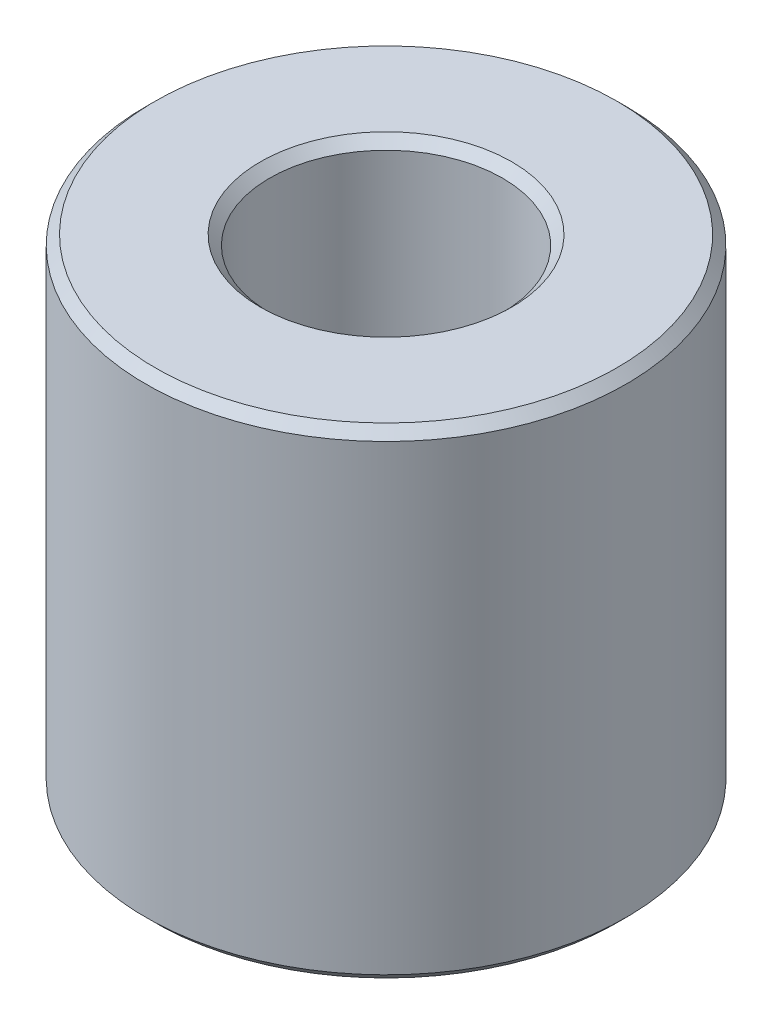
ISO-10303-21;
HEADER;
FILE_DESCRIPTION(('STEP AP214'),'2;1');
FILE_NAME('part.step','',(''),(''),'','','');
FILE_SCHEMA(('AUTOMOTIVE_DESIGN { 1 0 10303 214 1 1 1 1 }'));
ENDSEC;
DATA;
#1=APPLICATION_CONTEXT('core data for automotive mechanical design processes');
#2=APPLICATION_PROTOCOL_DEFINITION('international standard','automotive_design',2000,#1);
#3=PRODUCT_CONTEXT('',#1,'mechanical');
#4=PRODUCT('Part','Part','',(#3));
#5=PRODUCT_RELATED_PRODUCT_CATEGORY('part','',(#4));
#6=PRODUCT_DEFINITION_FORMATION('','',#4);
#7=PRODUCT_DEFINITION_CONTEXT('part definition',#1,'design');
#8=PRODUCT_DEFINITION('design','',#6,#7);
#9=PRODUCT_DEFINITION_SHAPE('','',#8);
#10=(LENGTH_UNIT() NAMED_UNIT(*) SI_UNIT(.MILLI.,.METRE.));
#11=(NAMED_UNIT(*) PLANE_ANGLE_UNIT() SI_UNIT($,.RADIAN.));
#12=(NAMED_UNIT(*) SI_UNIT($,.STERADIAN.) SOLID_ANGLE_UNIT());
#13=UNCERTAINTY_MEASURE_WITH_UNIT(LENGTH_MEASURE(1.E-05),#10,'distance_accuracy_value','');
#14=(GEOMETRIC_REPRESENTATION_CONTEXT(3) GLOBAL_UNCERTAINTY_ASSIGNED_CONTEXT((#13)) GLOBAL_UNIT_ASSIGNED_CONTEXT((#10,
#11,#12)) REPRESENTATION_CONTEXT('',''));
#15=CARTESIAN_POINT('',(0.,0.,0.));
#16=DIRECTION('',(0.,0.,1.));
#17=DIRECTION('',(1.,0.,0.));
#18=AXIS2_PLACEMENT_3D('',#15,#16,#17);
#19=CARTESIAN_POINT('',(3.404,13.,0.));
#20=DIRECTION('',(0.,1.,0.));
#21=DIRECTION('',(0.,0.,1.));
#22=AXIS2_PLACEMENT_3D('',#19,#20,#21);
#23=PLANE('',#22);
#24=CARTESIAN_POINT('',(0.,13.,0.));
#25=DIRECTION('',(0.,-1.,0.));
#26=DIRECTION('',(0.,0.,-1.));
#27=AXIS2_PLACEMENT_3D('',#24,#25,#26);
#28=CIRCLE('',#27,3.404);
#29=CARTESIAN_POINT('',(0.,13.,-3.404));
#30=VERTEX_POINT('',#29);
#31=EDGE_CURVE('E10',#30,#30,#28,.T.);
#32=ORIENTED_EDGE('',*,*,#31,.T.);
#33=EDGE_LOOP('',(#32));
#34=FACE_BOUND('',#33,.T.);
#35=CARTESIAN_POINT('',(0.,13.,0.));
#36=DIRECTION('',(0.,-1.,0.));
#37=DIRECTION('',(0.,0.,-1.));
#38=AXIS2_PLACEMENT_3D('',#35,#36,#37);
#39=CIRCLE('',#38,6.246);
#40=CARTESIAN_POINT('',(0.,13.,-6.246));
#41=VERTEX_POINT('',#40);
#42=EDGE_CURVE('E59',#41,#41,#39,.T.);
#43=ORIENTED_EDGE('',*,*,#42,.F.);
#44=EDGE_LOOP('',(#43));
#45=FACE_BOUND('',#44,.T.);
#46=ADVANCED_FACE('F31',(#34,#45),#23,.T.);
#47=CARTESIAN_POINT('',(0.,13.,0.));
#48=DIRECTION('',(0.,1.,0.));
#49=DIRECTION('',(0.,0.,1.));
#50=AXIS2_PLACEMENT_3D('',#47,#48,#49);
#51=CONICAL_SURFACE('',#50,3.404,0.785398163397447);
#52=CARTESIAN_POINT('',(0.,12.746,0.));
#53=DIRECTION('',(0.,-1.,0.));
#54=DIRECTION('',(0.,0.,-1.));
#55=AXIS2_PLACEMENT_3D('',#52,#53,#54);
#56=CIRCLE('',#55,3.15);
#57=CARTESIAN_POINT('',(0.,12.746,-3.15));
#58=VERTEX_POINT('',#57);
#59=EDGE_CURVE('E37',#58,#58,#56,.T.);
#60=ORIENTED_EDGE('',*,*,#59,.T.);
#61=EDGE_LOOP('',(#60));
#62=FACE_BOUND('',#61,.T.);
#63=ORIENTED_EDGE('',*,*,#31,.F.);
#64=EDGE_LOOP('',(#63));
#65=FACE_BOUND('',#64,.T.);
#66=ADVANCED_FACE('F67',(#62,#65),#51,.F.);
#67=CARTESIAN_POINT('',(0.,0.,0.));
#68=DIRECTION('',(0.,-1.,0.));
#69=DIRECTION('',(0.,0.,-1.));
#70=AXIS2_PLACEMENT_3D('',#67,#68,#69);
#71=CYLINDRICAL_SURFACE('',#70,3.15);
#72=CARTESIAN_POINT('',(0.,0.254,0.));
#73=DIRECTION('',(0.,-1.,0.));
#74=DIRECTION('',(0.,0.,-1.));
#75=AXIS2_PLACEMENT_3D('',#72,#73,#74);
#76=CIRCLE('',#75,3.15);
#77=CARTESIAN_POINT('',(0.,0.254,-3.15));
#78=VERTEX_POINT('',#77);
#79=EDGE_CURVE('E41',#78,#78,#76,.T.);
#80=ORIENTED_EDGE('',*,*,#79,.T.);
#81=EDGE_LOOP('',(#80));
#82=FACE_BOUND('',#81,.T.);
#83=ORIENTED_EDGE('',*,*,#59,.F.);
#84=EDGE_LOOP('',(#83));
#85=FACE_BOUND('',#84,.T.);
#86=ADVANCED_FACE('F71',(#82,#85),#71,.F.);
#87=CARTESIAN_POINT('',(0.,0.254,0.));
#88=DIRECTION('',(0.,-1.,0.));
#89=DIRECTION('',(0.,0.,-1.));
#90=AXIS2_PLACEMENT_3D('',#87,#88,#89);
#91=CONICAL_SURFACE('',#90,3.15,0.785398163397448);
#92=CARTESIAN_POINT('',(0.,0.,0.));
#93=DIRECTION('',(0.,-1.,0.));
#94=DIRECTION('',(0.,0.,-1.));
#95=AXIS2_PLACEMENT_3D('',#92,#93,#94);
#96=CIRCLE('',#95,3.404);
#97=CARTESIAN_POINT('',(0.,0.,-3.404));
#98=VERTEX_POINT('',#97);
#99=EDGE_CURVE('E45',#98,#98,#96,.T.);
#100=ORIENTED_EDGE('',*,*,#99,.T.);
#101=EDGE_LOOP('',(#100));
#102=FACE_BOUND('',#101,.T.);
#103=ORIENTED_EDGE('',*,*,#79,.F.);
#104=EDGE_LOOP('',(#103));
#105=FACE_BOUND('',#104,.T.);
#106=ADVANCED_FACE('F75',(#102,#105),#91,.F.);
#107=CARTESIAN_POINT('',(3.404,0.,0.));
#108=DIRECTION('',(0.,-1.,0.));
#109=DIRECTION('',(0.,0.,-1.));
#110=AXIS2_PLACEMENT_3D('',#107,#108,#109);
#111=PLANE('',#110);
#112=CARTESIAN_POINT('',(0.,0.,0.));
#113=DIRECTION('',(0.,-1.,0.));
#114=DIRECTION('',(0.,0.,-1.));
#115=AXIS2_PLACEMENT_3D('',#112,#113,#114);
#116=CIRCLE('',#115,6.246);
#117=CARTESIAN_POINT('',(0.,0.,-6.246));
#118=VERTEX_POINT('',#117);
#119=EDGE_CURVE('E50',#118,#118,#116,.T.);
#120=ORIENTED_EDGE('',*,*,#119,.T.);
#121=EDGE_LOOP('',(#120));
#122=FACE_BOUND('',#121,.T.);
#123=ORIENTED_EDGE('',*,*,#99,.F.);
#124=EDGE_LOOP('',(#123));
#125=FACE_BOUND('',#124,.T.);
#126=ADVANCED_FACE('F82',(#122,#125),#111,.T.);
#127=CARTESIAN_POINT('',(0.,0.,0.));
#128=DIRECTION('',(0.,1.,0.));
#129=DIRECTION('',(0.,0.,1.));
#130=AXIS2_PLACEMENT_3D('',#127,#128,#129);
#131=CONICAL_SURFACE('',#130,6.246,0.785398163397448);
#132=CARTESIAN_POINT('',(0.,0.254,0.));
#133=DIRECTION('',(0.,-1.,0.));
#134=DIRECTION('',(0.,0.,-1.));
#135=AXIS2_PLACEMENT_3D('',#132,#133,#134);
#136=CIRCLE('',#135,6.5);
#137=CARTESIAN_POINT('',(0.,0.254,-6.5));
#138=VERTEX_POINT('',#137);
#139=EDGE_CURVE('E53',#138,#138,#136,.T.);
#140=ORIENTED_EDGE('',*,*,#139,.T.);
#141=EDGE_LOOP('',(#140));
#142=FACE_BOUND('',#141,.T.);
#143=ORIENTED_EDGE('',*,*,#119,.F.);
#144=EDGE_LOOP('',(#143));
#145=FACE_BOUND('',#144,.T.);
#146=ADVANCED_FACE('F86',(#142,#145),#131,.T.);
#147=CARTESIAN_POINT('',(0.,0.,0.));
#148=DIRECTION('',(0.,-1.,0.));
#149=DIRECTION('',(0.,0.,-1.));
#150=AXIS2_PLACEMENT_3D('',#147,#148,#149);
#151=CYLINDRICAL_SURFACE('',#150,6.5);
#152=CARTESIAN_POINT('',(0.,12.746,0.));
#153=DIRECTION('',(0.,-1.,0.));
#154=DIRECTION('',(0.,0.,-1.));
#155=AXIS2_PLACEMENT_3D('',#152,#153,#154);
#156=CIRCLE('',#155,6.5);
#157=CARTESIAN_POINT('',(0.,12.746,-6.5));
#158=VERTEX_POINT('',#157);
#159=EDGE_CURVE('E56',#158,#158,#156,.T.);
#160=ORIENTED_EDGE('',*,*,#159,.T.);
#161=EDGE_LOOP('',(#160));
#162=FACE_BOUND('',#161,.T.);
#163=ORIENTED_EDGE('',*,*,#139,.F.);
#164=EDGE_LOOP('',(#163));
#165=FACE_BOUND('',#164,.T.);
#166=ADVANCED_FACE('F90',(#162,#165),#151,.T.);
#167=CARTESIAN_POINT('',(0.,12.746,0.));
#168=DIRECTION('',(0.,-1.,0.));
#169=DIRECTION('',(0.,0.,-1.));
#170=AXIS2_PLACEMENT_3D('',#167,#168,#169);
#171=CONICAL_SURFACE('',#170,6.5,0.785398163397447);
#172=ORIENTED_EDGE('',*,*,#42,.T.);
#173=EDGE_LOOP('',(#172));
#174=FACE_BOUND('',#173,.T.);
#175=ORIENTED_EDGE('',*,*,#159,.F.);
#176=EDGE_LOOP('',(#175));
#177=FACE_BOUND('',#176,.T.);
#178=ADVANCED_FACE('F63',(#174,#177),#171,.T.);
#179=CLOSED_SHELL('',(#46,#66,#86,#106,#126,#146,#166,#178));
#180=MANIFOLD_SOLID_BREP('B2',#179);
#181=ADVANCED_BREP_SHAPE_REPRESENTATION('',(#18,#180),#14);
#182=SHAPE_DEFINITION_REPRESENTATION(#9,#181);
ENDSEC;
END-ISO-10303-21;
